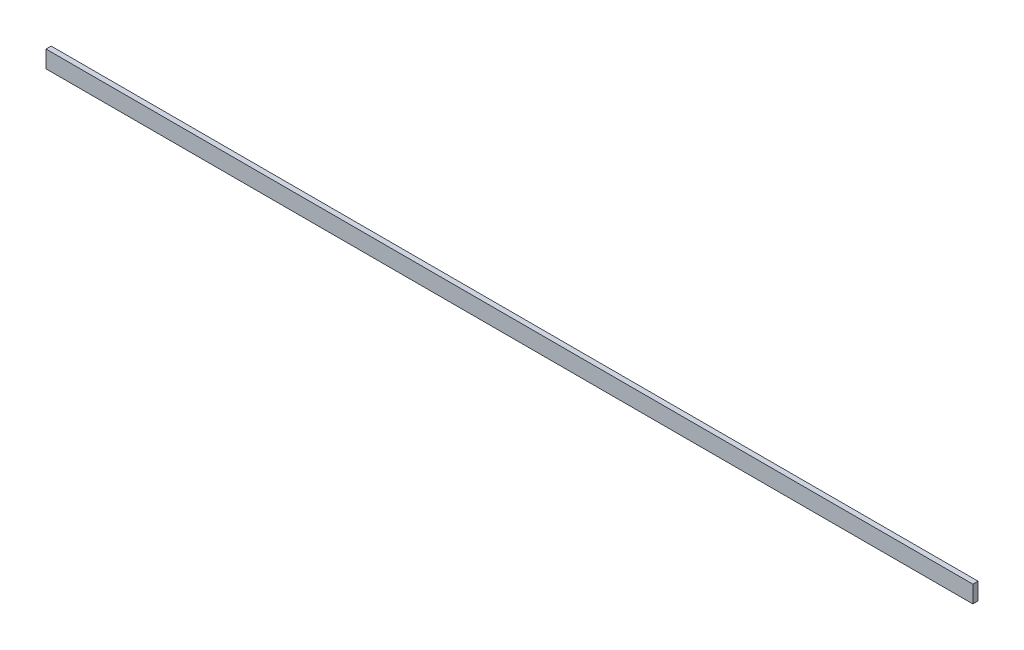
ISO-10303-21;
HEADER;
FILE_DESCRIPTION(('STEP AP214'),'2;1');
FILE_NAME('part.step','',(''),(''),'','','');
FILE_SCHEMA(('AUTOMOTIVE_DESIGN { 1 0 10303 214 1 1 1 1 }'));
ENDSEC;
DATA;
#1=APPLICATION_CONTEXT('core data for automotive mechanical design processes');
#2=APPLICATION_PROTOCOL_DEFINITION('international standard','automotive_design',2000,#1);
#3=PRODUCT_CONTEXT('',#1,'mechanical');
#4=PRODUCT('Part','Part','',(#3));
#5=PRODUCT_RELATED_PRODUCT_CATEGORY('part','',(#4));
#6=PRODUCT_DEFINITION_FORMATION('','',#4);
#7=PRODUCT_DEFINITION_CONTEXT('part definition',#1,'design');
#8=PRODUCT_DEFINITION('design','',#6,#7);
#9=PRODUCT_DEFINITION_SHAPE('','',#8);
#10=(LENGTH_UNIT() NAMED_UNIT(*) SI_UNIT(.MILLI.,.METRE.));
#11=(NAMED_UNIT(*) PLANE_ANGLE_UNIT() SI_UNIT($,.RADIAN.));
#12=(NAMED_UNIT(*) SI_UNIT($,.STERADIAN.) SOLID_ANGLE_UNIT());
#13=UNCERTAINTY_MEASURE_WITH_UNIT(LENGTH_MEASURE(1.E-05),#10,'distance_accuracy_value','');
#14=(GEOMETRIC_REPRESENTATION_CONTEXT(3) GLOBAL_UNCERTAINTY_ASSIGNED_CONTEXT((#13)) GLOBAL_UNIT_ASSIGNED_CONTEXT((#10,
#11,#12)) REPRESENTATION_CONTEXT('',''));
#15=CARTESIAN_POINT('',(0.,0.,0.));
#16=DIRECTION('',(0.,0.,1.));
#17=DIRECTION('',(1.,0.,0.));
#18=AXIS2_PLACEMENT_3D('',#15,#16,#17);
#19=CARTESIAN_POINT('',(270.,5.,3.));
#20=DIRECTION('',(-1.,0.,0.));
#21=DIRECTION('',(0.,0.,1.));
#22=AXIS2_PLACEMENT_3D('',#19,#20,#21);
#23=PLANE('',#22);
#24=DIRECTION('',(0.,1.,0.));
#25=VECTOR('',#24,1.);
#26=CARTESIAN_POINT('',(270.,5.,0.));
#27=LINE('',#26,#25);
#28=CARTESIAN_POINT('',(270.,-5.,0.));
#29=VERTEX_POINT('',#28);
#30=CARTESIAN_POINT('',(270.,5.,0.));
#31=VERTEX_POINT('',#30);
#32=EDGE_CURVE('E97',#29,#31,#27,.T.);
#33=ORIENTED_EDGE('',*,*,#32,.T.);
#34=DIRECTION('',(0.,0.,-1.));
#35=VECTOR('',#34,1.);
#36=CARTESIAN_POINT('',(270.,5.,3.));
#37=LINE('',#36,#35);
#38=CARTESIAN_POINT('',(270.,5.,3.));
#39=VERTEX_POINT('',#38);
#40=EDGE_CURVE('E11',#39,#31,#37,.T.);
#41=ORIENTED_EDGE('',*,*,#40,.F.);
#42=DIRECTION('',(0.,1.,0.));
#43=VECTOR('',#42,1.);
#44=CARTESIAN_POINT('',(270.,5.,3.));
#45=LINE('',#44,#43);
#46=CARTESIAN_POINT('',(270.,-5.,3.));
#47=VERTEX_POINT('',#46);
#48=EDGE_CURVE('E85',#47,#39,#45,.T.);
#49=ORIENTED_EDGE('',*,*,#48,.F.);
#50=DIRECTION('',(0.,0.,-1.));
#51=VECTOR('',#50,1.);
#52=CARTESIAN_POINT('',(270.,-5.,3.));
#53=LINE('',#52,#51);
#54=EDGE_CURVE('E93',#47,#29,#53,.T.);
#55=ORIENTED_EDGE('',*,*,#54,.T.);
#56=EDGE_LOOP('',(#33,#41,#49,#55));
#57=FACE_BOUND('',#56,.T.);
#58=ADVANCED_FACE('F34',(#57),#23,.F.);
#59=CARTESIAN_POINT('',(-270.,5.,3.));
#60=DIRECTION('',(0.,-1.,0.));
#61=DIRECTION('',(0.,0.,-1.));
#62=AXIS2_PLACEMENT_3D('',#59,#60,#61);
#63=PLANE('',#62);
#64=DIRECTION('',(-1.,0.,0.));
#65=VECTOR('',#64,1.);
#66=CARTESIAN_POINT('',(-270.,5.,0.));
#67=LINE('',#66,#65);
#68=CARTESIAN_POINT('',(-270.,5.,0.));
#69=VERTEX_POINT('',#68);
#70=EDGE_CURVE('E89',#31,#69,#67,.T.);
#71=ORIENTED_EDGE('',*,*,#70,.T.);
#72=DIRECTION('',(0.,0.,-1.));
#73=VECTOR('',#72,1.);
#74=CARTESIAN_POINT('',(-270.,5.,3.));
#75=LINE('',#74,#73);
#76=CARTESIAN_POINT('',(-270.,5.,3.));
#77=VERTEX_POINT('',#76);
#78=EDGE_CURVE('E42',#77,#69,#75,.T.);
#79=ORIENTED_EDGE('',*,*,#78,.F.);
#80=DIRECTION('',(-1.,0.,0.));
#81=VECTOR('',#80,1.);
#82=CARTESIAN_POINT('',(-270.,5.,3.));
#83=LINE('',#82,#81);
#84=EDGE_CURVE('E80',#39,#77,#83,.T.);
#85=ORIENTED_EDGE('',*,*,#84,.F.);
#86=ORIENTED_EDGE('',*,*,#40,.T.);
#87=EDGE_LOOP('',(#71,#79,#85,#86));
#88=FACE_BOUND('',#87,.T.);
#89=ADVANCED_FACE('F88',(#88),#63,.F.);
#90=CARTESIAN_POINT('',(-270.,5.,3.));
#91=DIRECTION('',(1.,0.,0.));
#92=DIRECTION('',(0.,0.,-1.));
#93=AXIS2_PLACEMENT_3D('',#90,#91,#92);
#94=PLANE('',#93);
#95=DIRECTION('',(0.,-1.,0.));
#96=VECTOR('',#95,1.);
#97=CARTESIAN_POINT('',(-270.,5.,0.));
#98=LINE('',#97,#96);
#99=CARTESIAN_POINT('',(-270.,-5.,0.));
#100=VERTEX_POINT('',#99);
#101=EDGE_CURVE('E67',#69,#100,#98,.T.);
#102=ORIENTED_EDGE('',*,*,#101,.T.);
#103=DIRECTION('',(0.,0.,-1.));
#104=VECTOR('',#103,1.);
#105=CARTESIAN_POINT('',(-270.,-5.,3.));
#106=LINE('',#105,#104);
#107=CARTESIAN_POINT('',(-270.,-5.,3.));
#108=VERTEX_POINT('',#107);
#109=EDGE_CURVE('E90',#108,#100,#106,.T.);
#110=ORIENTED_EDGE('',*,*,#109,.F.);
#111=DIRECTION('',(0.,-1.,0.));
#112=VECTOR('',#111,1.);
#113=CARTESIAN_POINT('',(-270.,5.,3.));
#114=LINE('',#113,#112);
#115=EDGE_CURVE('E83',#77,#108,#114,.T.);
#116=ORIENTED_EDGE('',*,*,#115,.F.);
#117=ORIENTED_EDGE('',*,*,#78,.T.);
#118=EDGE_LOOP('',(#102,#110,#116,#117));
#119=FACE_BOUND('',#118,.T.);
#120=ADVANCED_FACE('F91',(#119),#94,.F.);
#121=CARTESIAN_POINT('',(-270.,-5.,3.));
#122=DIRECTION('',(0.,1.,0.));
#123=DIRECTION('',(0.,0.,1.));
#124=AXIS2_PLACEMENT_3D('',#121,#122,#123);
#125=PLANE('',#124);
#126=DIRECTION('',(1.,0.,0.));
#127=VECTOR('',#126,1.);
#128=CARTESIAN_POINT('',(-270.,-5.,0.));
#129=LINE('',#128,#127);
#130=EDGE_CURVE('E73',#100,#29,#129,.T.);
#131=ORIENTED_EDGE('',*,*,#130,.T.);
#132=ORIENTED_EDGE('',*,*,#54,.F.);
#133=DIRECTION('',(1.,0.,0.));
#134=VECTOR('',#133,1.);
#135=CARTESIAN_POINT('',(-270.,-5.,3.));
#136=LINE('',#135,#134);
#137=EDGE_CURVE('E50',#108,#47,#136,.T.);
#138=ORIENTED_EDGE('',*,*,#137,.F.);
#139=ORIENTED_EDGE('',*,*,#109,.T.);
#140=EDGE_LOOP('',(#131,#132,#138,#139));
#141=FACE_BOUND('',#140,.T.);
#142=ADVANCED_FACE('F104',(#141),#125,.F.);
#143=CARTESIAN_POINT('',(0.,0.,3.));
#144=DIRECTION('',(0.,0.,1.));
#145=DIRECTION('',(1.,0.,0.));
#146=AXIS2_PLACEMENT_3D('',#143,#144,#145);
#147=PLANE('',#146);
#148=ORIENTED_EDGE('',*,*,#48,.T.);
#149=ORIENTED_EDGE('',*,*,#84,.T.);
#150=ORIENTED_EDGE('',*,*,#115,.T.);
#151=ORIENTED_EDGE('',*,*,#137,.T.);
#152=EDGE_LOOP('',(#148,#149,#150,#151));
#153=FACE_BOUND('',#152,.T.);
#154=ADVANCED_FACE('F81',(#153),#147,.T.);
#155=CARTESIAN_POINT('',(0.,0.,0.));
#156=DIRECTION('',(0.,0.,1.));
#157=DIRECTION('',(1.,0.,0.));
#158=AXIS2_PLACEMENT_3D('',#155,#156,#157);
#159=PLANE('',#158);
#160=ORIENTED_EDGE('',*,*,#32,.F.);
#161=ORIENTED_EDGE('',*,*,#130,.F.);
#162=ORIENTED_EDGE('',*,*,#101,.F.);
#163=ORIENTED_EDGE('',*,*,#70,.F.);
#164=EDGE_LOOP('',(#160,#161,#162,#163));
#165=FACE_BOUND('',#164,.T.);
#166=ADVANCED_FACE('F107',(#165),#159,.F.);
#167=CLOSED_SHELL('',(#58,#89,#120,#142,#154,#166));
#168=MANIFOLD_SOLID_BREP('B2',#167);
#169=ADVANCED_BREP_SHAPE_REPRESENTATION('',(#18,#168),#14);
#170=SHAPE_DEFINITION_REPRESENTATION(#9,#169);
ENDSEC;
END-ISO-10303-21;
